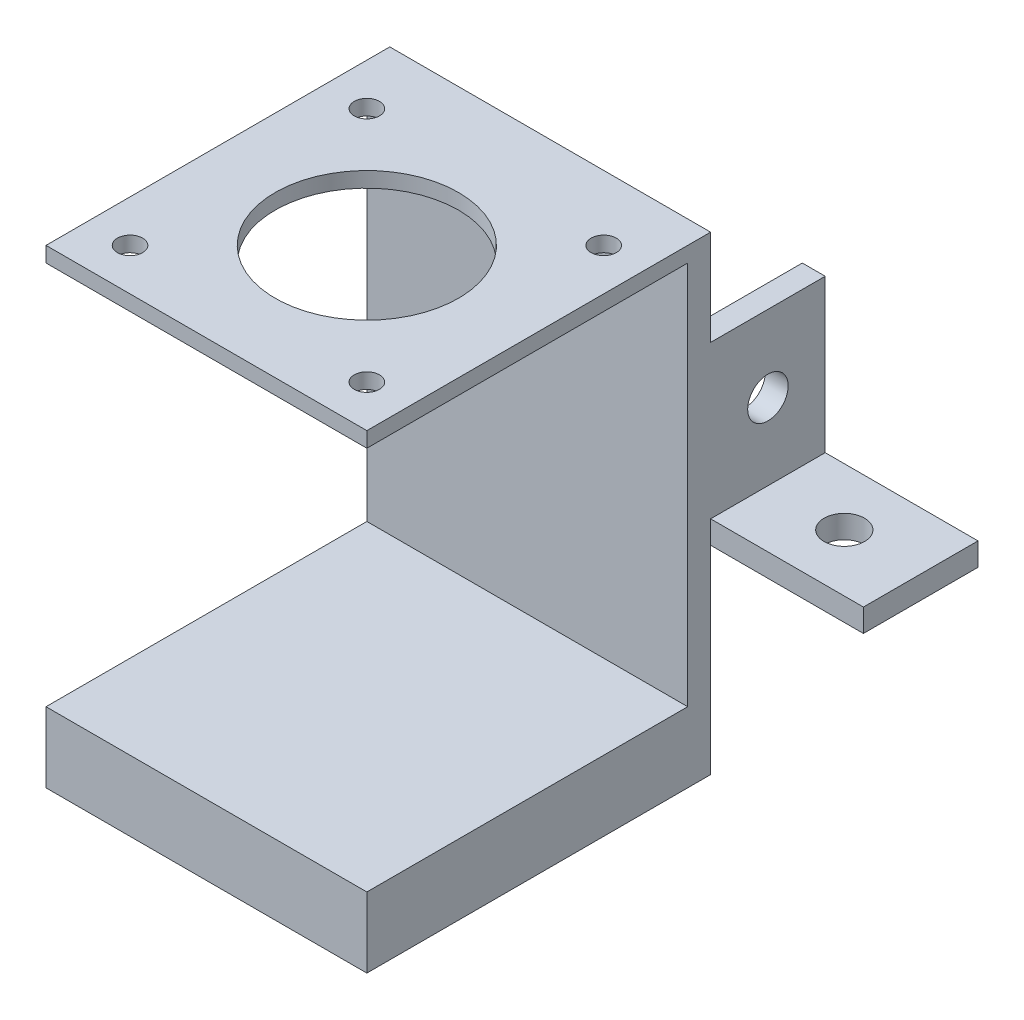
ISO-10303-21;
HEADER;
FILE_DESCRIPTION(('STEP AP214'),'2;1');
FILE_NAME('part.step','',(''),(''),'','','');
FILE_SCHEMA(('AUTOMOTIVE_DESIGN { 1 0 10303 214 1 1 1 1 }'));
ENDSEC;
DATA;
#1=APPLICATION_CONTEXT('core data for automotive mechanical design processes');
#2=APPLICATION_PROTOCOL_DEFINITION('international standard','automotive_design',2000,#1);
#3=PRODUCT_CONTEXT('',#1,'mechanical');
#4=PRODUCT('Part','Part','',(#3));
#5=PRODUCT_RELATED_PRODUCT_CATEGORY('part','',(#4));
#6=PRODUCT_DEFINITION_FORMATION('','',#4);
#7=PRODUCT_DEFINITION_CONTEXT('part definition',#1,'design');
#8=PRODUCT_DEFINITION('design','',#6,#7);
#9=PRODUCT_DEFINITION_SHAPE('','',#8);
#10=(LENGTH_UNIT() NAMED_UNIT(*) SI_UNIT(.MILLI.,.METRE.));
#11=(NAMED_UNIT(*) PLANE_ANGLE_UNIT() SI_UNIT($,.RADIAN.));
#12=(NAMED_UNIT(*) SI_UNIT($,.STERADIAN.) SOLID_ANGLE_UNIT());
#13=UNCERTAINTY_MEASURE_WITH_UNIT(LENGTH_MEASURE(1.E-05),#10,'distance_accuracy_value','');
#14=(GEOMETRIC_REPRESENTATION_CONTEXT(3) GLOBAL_UNCERTAINTY_ASSIGNED_CONTEXT((#13)) GLOBAL_UNIT_ASSIGNED_CONTEXT((#10,
#11,#12)) REPRESENTATION_CONTEXT('',''));
#15=CARTESIAN_POINT('',(0.,0.,0.));
#16=DIRECTION('',(0.,0.,1.));
#17=DIRECTION('',(1.,0.,0.));
#18=AXIS2_PLACEMENT_3D('',#15,#16,#17);
#19=CARTESIAN_POINT('',(23.8060344827586,11.3599137931034,3.));
#20=DIRECTION('',(-1.,0.,0.));
#21=DIRECTION('',(0.,-1.,0.));
#22=AXIS2_PLACEMENT_3D('',#19,#20,#21);
#23=PLANE('',#22);
#24=CARTESIAN_POINT('',(23.8060344827586,-11.1400862068966,-7.5));
#25=DIRECTION('',(-1.,0.,0.));
#26=DIRECTION('',(0.,-1.,0.));
#27=AXIS2_PLACEMENT_3D('',#24,#25,#26);
#28=CIRCLE('',#27,2.65);
#29=CARTESIAN_POINT('',(23.8060344827586,-13.7900862068966,-7.5));
#30=VERTEX_POINT('',#29);
#31=EDGE_CURVE('E169',#30,#30,#28,.T.);
#32=ORIENTED_EDGE('',*,*,#31,.T.);
#33=EDGE_LOOP('',(#32));
#34=FACE_BOUND('',#33,.T.);
#35=DIRECTION('',(0.,-1.,0.));
#36=VECTOR('',#35,1.);
#37=CARTESIAN_POINT('',(23.8060344827586,-24.1400862068966,0.));
#38=LINE('',#37,#36);
#39=CARTESIAN_POINT('',(23.8060344827586,-21.1400862068966,0.));
#40=VERTEX_POINT('',#39);
#41=CARTESIAN_POINT('',(23.8060344827586,-24.1400862068966,0.));
#42=VERTEX_POINT('',#41);
#43=EDGE_CURVE('E161',#40,#42,#38,.T.);
#44=ORIENTED_EDGE('',*,*,#43,.F.);
#45=DIRECTION('',(0.,0.,1.));
#46=VECTOR('',#45,1.);
#47=CARTESIAN_POINT('',(23.8060344827586,-21.1400862068966,-15.));
#48=LINE('',#47,#46);
#49=CARTESIAN_POINT('',(23.8060344827586,-21.1400862068966,-15.));
#50=VERTEX_POINT('',#49);
#51=EDGE_CURVE('E54',#50,#40,#48,.T.);
#52=ORIENTED_EDGE('',*,*,#51,.F.);
#53=DIRECTION('',(0.,-1.,0.));
#54=VECTOR('',#53,1.);
#55=CARTESIAN_POINT('',(23.8060344827586,-21.1400862068966,-15.));
#56=LINE('',#55,#54);
#57=CARTESIAN_POINT('',(23.8060344827586,-1.14008620689655,-15.));
#58=VERTEX_POINT('',#57);
#59=EDGE_CURVE('E165',#58,#50,#56,.T.);
#60=ORIENTED_EDGE('',*,*,#59,.F.);
#61=DIRECTION('',(0.,0.,1.));
#62=VECTOR('',#61,1.);
#63=CARTESIAN_POINT('',(23.8060344827586,-1.14008620689655,-15.));
#64=LINE('',#63,#62);
#65=CARTESIAN_POINT('',(23.8060344827586,-1.14008620689655,0.));
#66=VERTEX_POINT('',#65);
#67=EDGE_CURVE('E186',#58,#66,#64,.T.);
#68=ORIENTED_EDGE('',*,*,#67,.T.);
#69=DIRECTION('',(0.,1.,0.));
#70=VECTOR('',#69,1.);
#71=CARTESIAN_POINT('',(23.8060344827586,11.3599137931034,0.));
#72=LINE('',#71,#70);
#73=CARTESIAN_POINT('',(23.8060344827586,11.3599137931034,0.));
#74=VERTEX_POINT('',#73);
#75=EDGE_CURVE('E278',#66,#74,#72,.T.);
#76=ORIENTED_EDGE('',*,*,#75,.T.);
#77=DIRECTION('',(0.,0.,-1.));
#78=VECTOR('',#77,1.);
#79=CARTESIAN_POINT('',(23.8060344827586,11.3599137931034,3.));
#80=LINE('',#79,#78);
#81=CARTESIAN_POINT('',(23.8060344827586,11.3599137931034,45.));
#82=VERTEX_POINT('',#81);
#83=EDGE_CURVE('E285',#82,#74,#80,.T.);
#84=ORIENTED_EDGE('',*,*,#83,.F.);
#85=DIRECTION('',(0.,1.,0.));
#86=VECTOR('',#85,1.);
#87=CARTESIAN_POINT('',(23.8060344827586,11.3599137931034,45.));
#88=LINE('',#87,#86);
#89=CARTESIAN_POINT('',(23.8060344827586,9.35991379310345,45.));
#90=VERTEX_POINT('',#89);
#91=EDGE_CURVE('E252',#90,#82,#88,.T.);
#92=ORIENTED_EDGE('',*,*,#91,.F.);
#93=DIRECTION('',(0.,0.,-1.));
#94=VECTOR('',#93,1.);
#95=CARTESIAN_POINT('',(23.8060344827586,9.35991379310345,45.));
#96=LINE('',#95,#94);
#97=CARTESIAN_POINT('',(23.8060344827586,9.35991379310345,3.));
#98=VERTEX_POINT('',#97);
#99=EDGE_CURVE('E258',#90,#98,#96,.T.);
#100=ORIENTED_EDGE('',*,*,#99,.T.);
#101=DIRECTION('',(0.,1.,0.));
#102=VECTOR('',#101,1.);
#103=CARTESIAN_POINT('',(23.8060344827586,11.3599137931034,3.));
#104=LINE('',#103,#102);
#105=CARTESIAN_POINT('',(23.8060344827586,-40.9400862068966,3.));
#106=VERTEX_POINT('',#105);
#107=EDGE_CURVE('E270',#106,#98,#104,.T.);
#108=ORIENTED_EDGE('',*,*,#107,.F.);
#109=DIRECTION('',(0.,0.,-1.));
#110=VECTOR('',#109,1.);
#111=CARTESIAN_POINT('',(23.8060344827586,-40.9400862068966,45.));
#112=LINE('',#111,#110);
#113=CARTESIAN_POINT('',(23.8060344827586,-40.9400862068966,45.));
#114=VERTEX_POINT('',#113);
#115=EDGE_CURVE('E244',#114,#106,#112,.T.);
#116=ORIENTED_EDGE('',*,*,#115,.F.);
#117=DIRECTION('',(0.,1.,0.));
#118=VECTOR('',#117,1.);
#119=CARTESIAN_POINT('',(23.8060344827586,-50.1400862068966,45.));
#120=LINE('',#119,#118);
#121=CARTESIAN_POINT('',(23.8060344827586,-50.1400862068966,45.));
#122=VERTEX_POINT('',#121);
#123=EDGE_CURVE('E236',#122,#114,#120,.T.);
#124=ORIENTED_EDGE('',*,*,#123,.F.);
#125=DIRECTION('',(0.,0.,-1.));
#126=VECTOR('',#125,1.);
#127=CARTESIAN_POINT('',(23.8060344827586,-50.1400862068966,3.));
#128=LINE('',#127,#126);
#129=CARTESIAN_POINT('',(23.8060344827586,-50.1400862068966,0.));
#130=VERTEX_POINT('',#129);
#131=EDGE_CURVE('E47',#122,#130,#128,.T.);
#132=ORIENTED_EDGE('',*,*,#131,.T.);
#133=EDGE_CURVE('E279',#130,#42,#72,.T.);
#134=ORIENTED_EDGE('',*,*,#133,.T.);
#135=EDGE_LOOP('',(#44,#52,#60,#68,#76,#84,#92,#100,#108,#116,#124,#132,#134));
#136=FACE_BOUND('',#135,.T.);
#137=ADVANCED_FACE('F39',(#34,#136),#23,.F.);
#138=CARTESIAN_POINT('',(0.,0.,0.));
#139=DIRECTION('',(0.,0.,1.));
#140=DIRECTION('',(1.,0.,0.));
#141=AXIS2_PLACEMENT_3D('',#138,#139,#140);
#142=PLANE('',#141);
#143=DIRECTION('',(-1.,0.,0.));
#144=VECTOR('',#143,1.);
#145=CARTESIAN_POINT('',(23.8060344827586,-24.1400862068966,0.));
#146=LINE('',#145,#144);
#147=CARTESIAN_POINT('',(20.8060344827586,-24.1400862068966,0.));
#148=VERTEX_POINT('',#147);
#149=EDGE_CURVE('E177',#42,#148,#146,.T.);
#150=ORIENTED_EDGE('',*,*,#149,.F.);
#151=ORIENTED_EDGE('',*,*,#133,.F.);
#152=DIRECTION('',(1.,0.,0.));
#153=VECTOR('',#152,1.);
#154=CARTESIAN_POINT('',(-18.1939655172414,-50.1400862068966,0.));
#155=LINE('',#154,#153);
#156=CARTESIAN_POINT('',(-18.1939655172414,-50.1400862068966,0.));
#157=VERTEX_POINT('',#156);
#158=EDGE_CURVE('E276',#157,#130,#155,.T.);
#159=ORIENTED_EDGE('',*,*,#158,.F.);
#160=DIRECTION('',(0.,-1.,0.));
#161=VECTOR('',#160,1.);
#162=CARTESIAN_POINT('',(-18.1939655172414,11.3599137931034,0.));
#163=LINE('',#162,#161);
#164=CARTESIAN_POINT('',(-18.1939655172414,11.3599137931034,0.));
#165=VERTEX_POINT('',#164);
#166=EDGE_CURVE('E266',#165,#157,#163,.T.);
#167=ORIENTED_EDGE('',*,*,#166,.F.);
#168=DIRECTION('',(-1.,0.,0.));
#169=VECTOR('',#168,1.);
#170=CARTESIAN_POINT('',(-18.1939655172414,11.3599137931034,0.));
#171=LINE('',#170,#169);
#172=EDGE_CURVE('E271',#74,#165,#171,.T.);
#173=ORIENTED_EDGE('',*,*,#172,.F.);
#174=ORIENTED_EDGE('',*,*,#75,.F.);
#175=DIRECTION('',(1.,0.,0.));
#176=VECTOR('',#175,1.);
#177=CARTESIAN_POINT('',(23.8060344827586,-1.14008620689655,0.));
#178=LINE('',#177,#176);
#179=CARTESIAN_POINT('',(20.8060344827586,-1.14008620689655,0.));
#180=VERTEX_POINT('',#179);
#181=EDGE_CURVE('E180',#180,#66,#178,.T.);
#182=ORIENTED_EDGE('',*,*,#181,.F.);
#183=DIRECTION('',(0.,1.,0.));
#184=VECTOR('',#183,1.);
#185=CARTESIAN_POINT('',(20.8060344827586,-21.1400862068966,0.));
#186=LINE('',#185,#184);
#187=EDGE_CURVE('E62',#148,#180,#186,.T.);
#188=ORIENTED_EDGE('',*,*,#187,.F.);
#189=EDGE_LOOP('',(#150,#151,#159,#167,#173,#174,#182,#188));
#190=FACE_BOUND('',#189,.T.);
#191=ADVANCED_FACE('F294',(#190),#142,.F.);
#192=CARTESIAN_POINT('',(0.,0.,3.));
#193=DIRECTION('',(0.,0.,1.));
#194=DIRECTION('',(1.,0.,0.));
#195=AXIS2_PLACEMENT_3D('',#192,#193,#194);
#196=PLANE('',#195);
#197=DIRECTION('',(0.,-1.,0.));
#198=VECTOR('',#197,1.);
#199=CARTESIAN_POINT('',(-18.1939655172414,11.3599137931034,3.));
#200=LINE('',#199,#198);
#201=CARTESIAN_POINT('',(-18.1939655172414,9.35991379310345,3.));
#202=VERTEX_POINT('',#201);
#203=CARTESIAN_POINT('',(-18.1939655172414,-40.9400862068966,3.));
#204=VERTEX_POINT('',#203);
#205=EDGE_CURVE('E267',#202,#204,#200,.T.);
#206=ORIENTED_EDGE('',*,*,#205,.T.);
#207=DIRECTION('',(-1.,0.,0.));
#208=VECTOR('',#207,1.);
#209=CARTESIAN_POINT('',(-18.1939655172414,-40.9400862068966,3.));
#210=LINE('',#209,#208);
#211=EDGE_CURVE('E227',#106,#204,#210,.T.);
#212=ORIENTED_EDGE('',*,*,#211,.F.);
#213=ORIENTED_EDGE('',*,*,#107,.T.);
#214=DIRECTION('',(1.,0.,0.));
#215=VECTOR('',#214,1.);
#216=CARTESIAN_POINT('',(-18.1939655172414,9.35991379310345,3.));
#217=LINE('',#216,#215);
#218=EDGE_CURVE('E246',#202,#98,#217,.T.);
#219=ORIENTED_EDGE('',*,*,#218,.F.);
#220=EDGE_LOOP('',(#206,#212,#213,#219));
#221=FACE_BOUND('',#220,.T.);
#222=ADVANCED_FACE('F333',(#221),#196,.T.);
#223=CARTESIAN_POINT('',(-18.1939655172414,11.3599137931034,3.));
#224=DIRECTION('',(1.,0.,0.));
#225=DIRECTION('',(0.,1.,0.));
#226=AXIS2_PLACEMENT_3D('',#223,#224,#225);
#227=PLANE('',#226);
#228=ORIENTED_EDGE('',*,*,#166,.T.);
#229=DIRECTION('',(0.,0.,-1.));
#230=VECTOR('',#229,1.);
#231=CARTESIAN_POINT('',(-18.1939655172414,-50.1400862068966,3.));
#232=LINE('',#231,#230);
#233=CARTESIAN_POINT('',(-18.1939655172414,-50.1400862068966,45.));
#234=VERTEX_POINT('',#233);
#235=EDGE_CURVE('E11',#234,#157,#232,.T.);
#236=ORIENTED_EDGE('',*,*,#235,.F.);
#237=DIRECTION('',(0.,-1.,0.));
#238=VECTOR('',#237,1.);
#239=CARTESIAN_POINT('',(-18.1939655172414,-50.1400862068966,45.));
#240=LINE('',#239,#238);
#241=CARTESIAN_POINT('',(-18.1939655172414,-40.9400862068966,45.));
#242=VERTEX_POINT('',#241);
#243=EDGE_CURVE('E230',#242,#234,#240,.T.);
#244=ORIENTED_EDGE('',*,*,#243,.F.);
#245=DIRECTION('',(0.,0.,-1.));
#246=VECTOR('',#245,1.);
#247=CARTESIAN_POINT('',(-18.1939655172414,-40.9400862068966,45.));
#248=LINE('',#247,#246);
#249=EDGE_CURVE('E240',#242,#204,#248,.T.);
#250=ORIENTED_EDGE('',*,*,#249,.T.);
#251=ORIENTED_EDGE('',*,*,#205,.F.);
#252=DIRECTION('',(0.,0.,-1.));
#253=VECTOR('',#252,1.);
#254=CARTESIAN_POINT('',(-18.1939655172414,9.35991379310345,45.));
#255=LINE('',#254,#253);
#256=CARTESIAN_POINT('',(-18.1939655172414,9.35991379310345,45.));
#257=VERTEX_POINT('',#256);
#258=EDGE_CURVE('E263',#257,#202,#255,.T.);
#259=ORIENTED_EDGE('',*,*,#258,.F.);
#260=DIRECTION('',(0.,-1.,0.));
#261=VECTOR('',#260,1.);
#262=CARTESIAN_POINT('',(-18.1939655172414,11.3599137931034,45.));
#263=LINE('',#262,#261);
#264=CARTESIAN_POINT('',(-18.1939655172414,11.3599137931034,45.));
#265=VERTEX_POINT('',#264);
#266=EDGE_CURVE('E247',#265,#257,#263,.T.);
#267=ORIENTED_EDGE('',*,*,#266,.F.);
#268=DIRECTION('',(0.,0.,-1.));
#269=VECTOR('',#268,1.);
#270=CARTESIAN_POINT('',(-18.1939655172414,11.3599137931034,3.));
#271=LINE('',#270,#269);
#272=EDGE_CURVE('E273',#265,#165,#271,.T.);
#273=ORIENTED_EDGE('',*,*,#272,.T.);
#274=EDGE_LOOP('',(#228,#236,#244,#250,#251,#259,#267,#273));
#275=FACE_BOUND('',#274,.T.);
#276=ADVANCED_FACE('F41',(#275),#227,.F.);
#277=CARTESIAN_POINT('',(-18.1939655172414,-50.1400862068966,3.));
#278=DIRECTION('',(0.,1.,0.));
#279=DIRECTION('',(0.,0.,1.));
#280=AXIS2_PLACEMENT_3D('',#277,#278,#279);
#281=PLANE('',#280);
#282=ORIENTED_EDGE('',*,*,#158,.T.);
#283=ORIENTED_EDGE('',*,*,#131,.F.);
#284=DIRECTION('',(1.,0.,0.));
#285=VECTOR('',#284,1.);
#286=CARTESIAN_POINT('',(-18.1939655172414,-50.1400862068966,45.));
#287=LINE('',#286,#285);
#288=EDGE_CURVE('E233',#234,#122,#287,.T.);
#289=ORIENTED_EDGE('',*,*,#288,.F.);
#290=ORIENTED_EDGE('',*,*,#235,.T.);
#291=EDGE_LOOP('',(#282,#283,#289,#290));
#292=FACE_BOUND('',#291,.T.);
#293=ADVANCED_FACE('F337',(#292),#281,.F.);
#294=CARTESIAN_POINT('',(-18.1939655172414,11.3599137931034,3.));
#295=DIRECTION('',(0.,-1.,0.));
#296=DIRECTION('',(0.,0.,-1.));
#297=AXIS2_PLACEMENT_3D('',#294,#295,#296);
#298=PLANE('',#297);
#299=CARTESIAN_POINT('',(-12.6939655172412,11.3599137931034,39.4999999999997));
#300=DIRECTION('',(0.,-1.,0.));
#301=DIRECTION('',(0.,0.,-1.));
#302=AXIS2_PLACEMENT_3D('',#299,#300,#301);
#303=CIRCLE('',#302,1.65);
#304=CARTESIAN_POINT('',(-12.6939655172412,11.3599137931034,37.8499999999997));
#305=VERTEX_POINT('',#304);
#306=EDGE_CURVE('E219',#305,#305,#303,.T.);
#307=ORIENTED_EDGE('',*,*,#306,.T.);
#308=EDGE_LOOP('',(#307));
#309=FACE_BOUND('',#308,.T.);
#310=CARTESIAN_POINT('',(-12.6939655172411,11.3599137931034,8.49999999999968));
#311=DIRECTION('',(0.,-1.,0.));
#312=DIRECTION('',(0.,0.,-1.));
#313=AXIS2_PLACEMENT_3D('',#310,#311,#312);
#314=CIRCLE('',#313,1.64999999999999);
#315=CARTESIAN_POINT('',(-12.6939655172411,11.3599137931034,6.84999999999969));
#316=VERTEX_POINT('',#315);
#317=EDGE_CURVE('E213',#316,#316,#314,.T.);
#318=ORIENTED_EDGE('',*,*,#317,.T.);
#319=EDGE_LOOP('',(#318));
#320=FACE_BOUND('',#319,.T.);
#321=CARTESIAN_POINT('',(18.306034482759,11.3599137931034,8.49999999999994));
#322=DIRECTION('',(0.,-1.,0.));
#323=DIRECTION('',(0.,0.,-1.));
#324=AXIS2_PLACEMENT_3D('',#321,#322,#323);
#325=CIRCLE('',#324,1.65);
#326=CARTESIAN_POINT('',(18.306034482759,11.3599137931034,6.84999999999995));
#327=VERTEX_POINT('',#326);
#328=EDGE_CURVE('E207',#327,#327,#325,.T.);
#329=ORIENTED_EDGE('',*,*,#328,.T.);
#330=EDGE_LOOP('',(#329));
#331=FACE_BOUND('',#330,.T.);
#332=CARTESIAN_POINT('',(18.3060344827586,11.3599137931034,39.5));
#333=DIRECTION('',(0.,-1.,0.));
#334=DIRECTION('',(0.,0.,-1.));
#335=AXIS2_PLACEMENT_3D('',#332,#333,#334);
#336=CIRCLE('',#335,1.65);
#337=CARTESIAN_POINT('',(18.3060344827586,11.3599137931034,37.85));
#338=VERTEX_POINT('',#337);
#339=EDGE_CURVE('E200',#338,#338,#336,.T.);
#340=ORIENTED_EDGE('',*,*,#339,.T.);
#341=EDGE_LOOP('',(#340));
#342=FACE_BOUND('',#341,.T.);
#343=CARTESIAN_POINT('',(2.80603448275863,11.3599137931034,24.));
#344=DIRECTION('',(0.,-1.,0.));
#345=DIRECTION('',(0.,0.,-1.));
#346=AXIS2_PLACEMENT_3D('',#343,#344,#345);
#347=CIRCLE('',#346,12.);
#348=CARTESIAN_POINT('',(2.80603448275863,11.3599137931034,12.));
#349=VERTEX_POINT('',#348);
#350=EDGE_CURVE('E224',#349,#349,#347,.T.);
#351=ORIENTED_EDGE('',*,*,#350,.T.);
#352=EDGE_LOOP('',(#351));
#353=FACE_BOUND('',#352,.T.);
#354=ORIENTED_EDGE('',*,*,#172,.T.);
#355=ORIENTED_EDGE('',*,*,#272,.F.);
#356=DIRECTION('',(-1.,0.,0.));
#357=VECTOR('',#356,1.);
#358=CARTESIAN_POINT('',(-18.1939655172414,11.3599137931034,45.));
#359=LINE('',#358,#357);
#360=EDGE_CURVE('E255',#82,#265,#359,.T.);
#361=ORIENTED_EDGE('',*,*,#360,.F.);
#362=ORIENTED_EDGE('',*,*,#83,.T.);
#363=EDGE_LOOP('',(#354,#355,#361,#362));
#364=FACE_BOUND('',#363,.T.);
#365=ADVANCED_FACE('F336',(#309,#320,#331,#342,#353,#364),#298,.F.);
#366=CARTESIAN_POINT('',(-18.1939655172414,9.35991379310345,45.));
#367=DIRECTION('',(0.,1.,0.));
#368=DIRECTION('',(-1.,0.,0.));
#369=AXIS2_PLACEMENT_3D('',#366,#367,#368);
#370=PLANE('',#369);
#371=CARTESIAN_POINT('',(-12.6939655172412,9.35991379310345,39.4999999999997));
#372=DIRECTION('',(0.,-1.,0.));
#373=DIRECTION('',(0.,0.,-1.));
#374=AXIS2_PLACEMENT_3D('',#371,#372,#373);
#375=CIRCLE('',#374,1.65);
#376=CARTESIAN_POINT('',(-12.6939655172412,9.35991379310345,37.8499999999997));
#377=VERTEX_POINT('',#376);
#378=EDGE_CURVE('E199',#377,#377,#375,.T.);
#379=ORIENTED_EDGE('',*,*,#378,.F.);
#380=EDGE_LOOP('',(#379));
#381=FACE_BOUND('',#380,.T.);
#382=CARTESIAN_POINT('',(-12.6939655172411,9.35991379310345,8.49999999999968));
#383=DIRECTION('',(0.,-1.,0.));
#384=DIRECTION('',(0.,0.,-1.));
#385=AXIS2_PLACEMENT_3D('',#382,#383,#384);
#386=CIRCLE('',#385,1.64999999999999);
#387=CARTESIAN_POINT('',(-12.6939655172411,9.35991379310345,6.84999999999969));
#388=VERTEX_POINT('',#387);
#389=EDGE_CURVE('E216',#388,#388,#386,.T.);
#390=ORIENTED_EDGE('',*,*,#389,.F.);
#391=EDGE_LOOP('',(#390));
#392=FACE_BOUND('',#391,.T.);
#393=CARTESIAN_POINT('',(18.306034482759,9.35991379310345,8.49999999999994));
#394=DIRECTION('',(0.,-1.,0.));
#395=DIRECTION('',(0.,0.,-1.));
#396=AXIS2_PLACEMENT_3D('',#393,#394,#395);
#397=CIRCLE('',#396,1.65);
#398=CARTESIAN_POINT('',(18.306034482759,9.35991379310345,6.84999999999995));
#399=VERTEX_POINT('',#398);
#400=EDGE_CURVE('E210',#399,#399,#397,.T.);
#401=ORIENTED_EDGE('',*,*,#400,.F.);
#402=EDGE_LOOP('',(#401));
#403=FACE_BOUND('',#402,.T.);
#404=CARTESIAN_POINT('',(18.3060344827586,9.35991379310345,39.5));
#405=DIRECTION('',(0.,-1.,0.));
#406=DIRECTION('',(0.,0.,-1.));
#407=AXIS2_PLACEMENT_3D('',#404,#405,#406);
#408=CIRCLE('',#407,1.65);
#409=CARTESIAN_POINT('',(18.3060344827586,9.35991379310345,37.85));
#410=VERTEX_POINT('',#409);
#411=EDGE_CURVE('E204',#410,#410,#408,.T.);
#412=ORIENTED_EDGE('',*,*,#411,.F.);
#413=EDGE_LOOP('',(#412));
#414=FACE_BOUND('',#413,.T.);
#415=CARTESIAN_POINT('',(2.80603448275863,9.35991379310345,24.));
#416=DIRECTION('',(0.,-1.,0.));
#417=DIRECTION('',(0.,0.,-1.));
#418=AXIS2_PLACEMENT_3D('',#415,#416,#417);
#419=CIRCLE('',#418,12.);
#420=CARTESIAN_POINT('',(2.80603448275863,9.35991379310345,12.));
#421=VERTEX_POINT('',#420);
#422=EDGE_CURVE('E203',#421,#421,#419,.T.);
#423=ORIENTED_EDGE('',*,*,#422,.F.);
#424=EDGE_LOOP('',(#423));
#425=FACE_BOUND('',#424,.T.);
#426=ORIENTED_EDGE('',*,*,#218,.T.);
#427=ORIENTED_EDGE('',*,*,#99,.F.);
#428=DIRECTION('',(1.,0.,0.));
#429=VECTOR('',#428,1.);
#430=CARTESIAN_POINT('',(-18.1939655172414,9.35991379310345,45.));
#431=LINE('',#430,#429);
#432=EDGE_CURVE('E250',#257,#90,#431,.T.);
#433=ORIENTED_EDGE('',*,*,#432,.F.);
#434=ORIENTED_EDGE('',*,*,#258,.T.);
#435=EDGE_LOOP('',(#426,#427,#433,#434));
#436=FACE_BOUND('',#435,.T.);
#437=ADVANCED_FACE('F344',(#381,#392,#403,#414,#425,#436),#370,.F.);
#438=CARTESIAN_POINT('',(0.,0.,45.));
#439=DIRECTION('',(0.,0.,1.));
#440=DIRECTION('',(1.,0.,0.));
#441=AXIS2_PLACEMENT_3D('',#438,#439,#440);
#442=PLANE('',#441);
#443=ORIENTED_EDGE('',*,*,#266,.T.);
#444=ORIENTED_EDGE('',*,*,#432,.T.);
#445=ORIENTED_EDGE('',*,*,#91,.T.);
#446=ORIENTED_EDGE('',*,*,#360,.T.);
#447=EDGE_LOOP('',(#443,#444,#445,#446));
#448=FACE_BOUND('',#447,.T.);
#449=ADVANCED_FACE('F354',(#448),#442,.T.);
#450=CARTESIAN_POINT('',(-18.1939655172414,-40.9400862068966,45.));
#451=DIRECTION('',(0.,-1.,0.));
#452=DIRECTION('',(0.,0.,-1.));
#453=AXIS2_PLACEMENT_3D('',#450,#451,#452);
#454=PLANE('',#453);
#455=ORIENTED_EDGE('',*,*,#211,.T.);
#456=ORIENTED_EDGE('',*,*,#249,.F.);
#457=DIRECTION('',(-1.,0.,0.));
#458=VECTOR('',#457,1.);
#459=CARTESIAN_POINT('',(-18.1939655172414,-40.9400862068966,45.));
#460=LINE('',#459,#458);
#461=EDGE_CURVE('E238',#114,#242,#460,.T.);
#462=ORIENTED_EDGE('',*,*,#461,.F.);
#463=ORIENTED_EDGE('',*,*,#115,.T.);
#464=EDGE_LOOP('',(#455,#456,#462,#463));
#465=FACE_BOUND('',#464,.T.);
#466=ADVANCED_FACE('F365',(#465),#454,.F.);
#467=CARTESIAN_POINT('',(0.,0.,45.));
#468=DIRECTION('',(0.,0.,-1.));
#469=DIRECTION('',(-1.,0.,0.));
#470=AXIS2_PLACEMENT_3D('',#467,#468,#469);
#471=PLANE('',#470);
#472=ORIENTED_EDGE('',*,*,#243,.T.);
#473=ORIENTED_EDGE('',*,*,#288,.T.);
#474=ORIENTED_EDGE('',*,*,#123,.T.);
#475=ORIENTED_EDGE('',*,*,#461,.T.);
#476=EDGE_LOOP('',(#472,#473,#474,#475));
#477=FACE_BOUND('',#476,.T.);
#478=ADVANCED_FACE('F367',(#477),#471,.F.);
#479=CARTESIAN_POINT('',(2.80603448275863,11.3599137931034,24.));
#480=DIRECTION('',(0.,-1.,0.));
#481=DIRECTION('',(0.,0.,-1.));
#482=AXIS2_PLACEMENT_3D('',#479,#480,#481);
#483=CYLINDRICAL_SURFACE('',#482,12.);
#484=ORIENTED_EDGE('',*,*,#350,.F.);
#485=EDGE_LOOP('',(#484));
#486=FACE_BOUND('',#485,.T.);
#487=ORIENTED_EDGE('',*,*,#422,.T.);
#488=EDGE_LOOP('',(#487));
#489=FACE_BOUND('',#488,.T.);
#490=ADVANCED_FACE('F369',(#486,#489),#483,.F.);
#491=CARTESIAN_POINT('',(18.3060344827586,11.3599137931034,39.5));
#492=DIRECTION('',(0.,-1.,0.));
#493=DIRECTION('',(0.,0.,-1.));
#494=AXIS2_PLACEMENT_3D('',#491,#492,#493);
#495=CYLINDRICAL_SURFACE('',#494,1.65);
#496=ORIENTED_EDGE('',*,*,#339,.F.);
#497=EDGE_LOOP('',(#496));
#498=FACE_BOUND('',#497,.T.);
#499=ORIENTED_EDGE('',*,*,#411,.T.);
#500=EDGE_LOOP('',(#499));
#501=FACE_BOUND('',#500,.T.);
#502=ADVANCED_FACE('F375',(#498,#501),#495,.F.);
#503=CARTESIAN_POINT('',(18.306034482759,11.3599137931034,8.49999999999994));
#504=DIRECTION('',(0.,-1.,0.));
#505=DIRECTION('',(0.,0.,-1.));
#506=AXIS2_PLACEMENT_3D('',#503,#504,#505);
#507=CYLINDRICAL_SURFACE('',#506,1.65);
#508=ORIENTED_EDGE('',*,*,#328,.F.);
#509=EDGE_LOOP('',(#508));
#510=FACE_BOUND('',#509,.T.);
#511=ORIENTED_EDGE('',*,*,#400,.T.);
#512=EDGE_LOOP('',(#511));
#513=FACE_BOUND('',#512,.T.);
#514=ADVANCED_FACE('F433',(#510,#513),#507,.F.);
#515=CARTESIAN_POINT('',(-12.6939655172411,11.3599137931034,8.49999999999968));
#516=DIRECTION('',(0.,-1.,0.));
#517=DIRECTION('',(0.,0.,-1.));
#518=AXIS2_PLACEMENT_3D('',#515,#516,#517);
#519=CYLINDRICAL_SURFACE('',#518,1.64999999999999);
#520=ORIENTED_EDGE('',*,*,#317,.F.);
#521=EDGE_LOOP('',(#520));
#522=FACE_BOUND('',#521,.T.);
#523=ORIENTED_EDGE('',*,*,#389,.T.);
#524=EDGE_LOOP('',(#523));
#525=FACE_BOUND('',#524,.T.);
#526=ADVANCED_FACE('F441',(#522,#525),#519,.F.);
#527=CARTESIAN_POINT('',(-12.6939655172412,11.3599137931034,39.4999999999997));
#528=DIRECTION('',(0.,-1.,0.));
#529=DIRECTION('',(0.,0.,-1.));
#530=AXIS2_PLACEMENT_3D('',#527,#528,#529);
#531=CYLINDRICAL_SURFACE('',#530,1.65);
#532=ORIENTED_EDGE('',*,*,#306,.F.);
#533=EDGE_LOOP('',(#532));
#534=FACE_BOUND('',#533,.T.);
#535=ORIENTED_EDGE('',*,*,#378,.T.);
#536=EDGE_LOOP('',(#535));
#537=FACE_BOUND('',#536,.T.);
#538=ADVANCED_FACE('F449',(#534,#537),#531,.F.);
#539=CARTESIAN_POINT('',(23.8060344827586,-24.1400862068966,-15.));
#540=DIRECTION('',(0.,1.,0.));
#541=DIRECTION('',(0.,0.,1.));
#542=AXIS2_PLACEMENT_3D('',#539,#540,#541);
#543=PLANE('',#542);
#544=CARTESIAN_POINT('',(33.8060344827586,-24.1400862068966,-7.5));
#545=DIRECTION('',(0.,1.,0.));
#546=DIRECTION('',(0.,0.,1.));
#547=AXIS2_PLACEMENT_3D('',#544,#545,#546);
#548=CIRCLE('',#547,2.65);
#549=CARTESIAN_POINT('',(33.8060344827586,-24.1400862068966,-4.85));
#550=VERTEX_POINT('',#549);
#551=EDGE_CURVE('E311',#550,#550,#548,.T.);
#552=ORIENTED_EDGE('',*,*,#551,.T.);
#553=EDGE_LOOP('',(#552));
#554=FACE_BOUND('',#553,.T.);
#555=ORIENTED_EDGE('',*,*,#149,.T.);
#556=DIRECTION('',(0.,0.,1.));
#557=VECTOR('',#556,1.);
#558=CARTESIAN_POINT('',(20.8060344827586,-24.1400862068966,-15.));
#559=LINE('',#558,#557);
#560=CARTESIAN_POINT('',(20.8060344827586,-24.1400862068966,-15.));
#561=VERTEX_POINT('',#560);
#562=EDGE_CURVE('E196',#561,#148,#559,.T.);
#563=ORIENTED_EDGE('',*,*,#562,.F.);
#564=DIRECTION('',(-1.,0.,0.));
#565=VECTOR('',#564,1.);
#566=CARTESIAN_POINT('',(23.8060344827586,-24.1400862068966,-15.));
#567=LINE('',#566,#565);
#568=CARTESIAN_POINT('',(43.8060344827586,-24.1400862068966,-15.));
#569=VERTEX_POINT('',#568);
#570=EDGE_CURVE('E179',#569,#561,#567,.T.);
#571=ORIENTED_EDGE('',*,*,#570,.F.);
#572=DIRECTION('',(0.,0.,-1.));
#573=VECTOR('',#572,1.);
#574=CARTESIAN_POINT('',(43.8060344827586,-24.1400862068966,-15.));
#575=LINE('',#574,#573);
#576=CARTESIAN_POINT('',(43.8060344827586,-24.1400862068966,0.));
#577=VERTEX_POINT('',#576);
#578=EDGE_CURVE('E159',#577,#569,#575,.T.);
#579=ORIENTED_EDGE('',*,*,#578,.F.);
#580=DIRECTION('',(-1.,0.,0.));
#581=VECTOR('',#580,1.);
#582=CARTESIAN_POINT('',(43.8060344827586,-24.1400862068966,0.));
#583=LINE('',#582,#581);
#584=EDGE_CURVE('E171',#577,#42,#583,.T.);
#585=ORIENTED_EDGE('',*,*,#584,.T.);
#586=EDGE_LOOP('',(#555,#563,#571,#579,#585));
#587=FACE_BOUND('',#586,.T.);
#588=ADVANCED_FACE('F299',(#554,#587),#543,.F.);
#589=CARTESIAN_POINT('',(20.8060344827586,-21.1400862068966,-15.));
#590=DIRECTION('',(1.,0.,0.));
#591=DIRECTION('',(0.,0.,-1.));
#592=AXIS2_PLACEMENT_3D('',#589,#590,#591);
#593=PLANE('',#592);
#594=CARTESIAN_POINT('',(20.8060344827586,-11.1400862068966,-7.5));
#595=DIRECTION('',(-1.,0.,0.));
#596=DIRECTION('',(0.,0.,1.));
#597=AXIS2_PLACEMENT_3D('',#594,#595,#596);
#598=CIRCLE('',#597,2.65);
#599=CARTESIAN_POINT('',(20.8060344827586,-11.1400862068966,-4.85));
#600=VERTEX_POINT('',#599);
#601=EDGE_CURVE('E166',#600,#600,#598,.T.);
#602=ORIENTED_EDGE('',*,*,#601,.F.);
#603=EDGE_LOOP('',(#602));
#604=FACE_BOUND('',#603,.T.);
#605=ORIENTED_EDGE('',*,*,#187,.T.);
#606=DIRECTION('',(0.,0.,1.));
#607=VECTOR('',#606,1.);
#608=CARTESIAN_POINT('',(20.8060344827586,-1.14008620689655,-15.));
#609=LINE('',#608,#607);
#610=CARTESIAN_POINT('',(20.8060344827586,-1.14008620689655,-15.));
#611=VERTEX_POINT('',#610);
#612=EDGE_CURVE('E193',#611,#180,#609,.T.);
#613=ORIENTED_EDGE('',*,*,#612,.F.);
#614=DIRECTION('',(0.,1.,0.));
#615=VECTOR('',#614,1.);
#616=CARTESIAN_POINT('',(20.8060344827586,-21.1400862068966,-15.));
#617=LINE('',#616,#615);
#618=EDGE_CURVE('E182',#561,#611,#617,.T.);
#619=ORIENTED_EDGE('',*,*,#618,.F.);
#620=ORIENTED_EDGE('',*,*,#562,.T.);
#621=EDGE_LOOP('',(#605,#613,#619,#620));
#622=FACE_BOUND('',#621,.T.);
#623=ADVANCED_FACE('F303',(#604,#622),#593,.F.);
#624=CARTESIAN_POINT('',(23.8060344827586,-1.14008620689655,-15.));
#625=DIRECTION('',(0.,-1.,0.));
#626=DIRECTION('',(0.,0.,-1.));
#627=AXIS2_PLACEMENT_3D('',#624,#625,#626);
#628=PLANE('',#627);
#629=ORIENTED_EDGE('',*,*,#181,.T.);
#630=ORIENTED_EDGE('',*,*,#67,.F.);
#631=DIRECTION('',(1.,0.,0.));
#632=VECTOR('',#631,1.);
#633=CARTESIAN_POINT('',(23.8060344827586,-1.14008620689655,-15.));
#634=LINE('',#633,#632);
#635=EDGE_CURVE('E184',#611,#58,#634,.T.);
#636=ORIENTED_EDGE('',*,*,#635,.F.);
#637=ORIENTED_EDGE('',*,*,#612,.T.);
#638=EDGE_LOOP('',(#629,#630,#636,#637));
#639=FACE_BOUND('',#638,.T.);
#640=ADVANCED_FACE('F478',(#639),#628,.F.);
#641=CARTESIAN_POINT('',(0.,0.,-15.));
#642=DIRECTION('',(0.,0.,-1.));
#643=DIRECTION('',(-1.,0.,0.));
#644=AXIS2_PLACEMENT_3D('',#641,#642,#643);
#645=PLANE('',#644);
#646=ORIENTED_EDGE('',*,*,#59,.T.);
#647=DIRECTION('',(-1.,0.,0.));
#648=VECTOR('',#647,1.);
#649=CARTESIAN_POINT('',(43.8060344827586,-21.1400862068966,-15.));
#650=LINE('',#649,#648);
#651=CARTESIAN_POINT('',(43.8060344827586,-21.1400862068966,-15.));
#652=VERTEX_POINT('',#651);
#653=EDGE_CURVE('E147',#652,#50,#650,.T.);
#654=ORIENTED_EDGE('',*,*,#653,.F.);
#655=DIRECTION('',(0.,1.,0.));
#656=VECTOR('',#655,1.);
#657=CARTESIAN_POINT('',(43.8060344827586,-24.1400862068966,-15.));
#658=LINE('',#657,#656);
#659=EDGE_CURVE('E153',#569,#652,#658,.T.);
#660=ORIENTED_EDGE('',*,*,#659,.F.);
#661=ORIENTED_EDGE('',*,*,#570,.T.);
#662=ORIENTED_EDGE('',*,*,#618,.T.);
#663=ORIENTED_EDGE('',*,*,#635,.T.);
#664=EDGE_LOOP('',(#646,#654,#660,#661,#662,#663));
#665=FACE_BOUND('',#664,.T.);
#666=ADVANCED_FACE('F163',(#665),#645,.T.);
#667=CARTESIAN_POINT('',(25.8060344827586,-11.1400862068966,-7.5));
#668=DIRECTION('',(-1.,0.,0.));
#669=DIRECTION('',(0.,0.,1.));
#670=AXIS2_PLACEMENT_3D('',#667,#668,#669);
#671=CYLINDRICAL_SURFACE('',#670,2.65);
#672=ORIENTED_EDGE('',*,*,#601,.T.);
#673=EDGE_LOOP('',(#672));
#674=FACE_BOUND('',#673,.T.);
#675=ORIENTED_EDGE('',*,*,#31,.F.);
#676=EDGE_LOOP('',(#675));
#677=FACE_BOUND('',#676,.T.);
#678=ADVANCED_FACE('F323',(#674,#677),#671,.F.);
#679=CARTESIAN_POINT('',(43.8060344827586,-21.1400862068966,-15.));
#680=DIRECTION('',(0.,-1.,0.));
#681=DIRECTION('',(0.,0.,-1.));
#682=AXIS2_PLACEMENT_3D('',#679,#680,#681);
#683=PLANE('',#682);
#684=CARTESIAN_POINT('',(33.8060344827586,-21.1400862068966,-7.5));
#685=DIRECTION('',(0.,1.,0.));
#686=DIRECTION('',(0.,0.,1.));
#687=AXIS2_PLACEMENT_3D('',#684,#685,#686);
#688=CIRCLE('',#687,2.65);
#689=CARTESIAN_POINT('',(33.8060344827586,-21.1400862068966,-4.85));
#690=VERTEX_POINT('',#689);
#691=EDGE_CURVE('E540',#690,#690,#688,.T.);
#692=ORIENTED_EDGE('',*,*,#691,.F.);
#693=EDGE_LOOP('',(#692));
#694=FACE_BOUND('',#693,.T.);
#695=ORIENTED_EDGE('',*,*,#51,.T.);
#696=DIRECTION('',(-1.,0.,0.));
#697=VECTOR('',#696,1.);
#698=CARTESIAN_POINT('',(43.8060344827586,-21.1400862068966,0.));
#699=LINE('',#698,#697);
#700=CARTESIAN_POINT('',(43.8060344827586,-21.1400862068966,0.));
#701=VERTEX_POINT('',#700);
#702=EDGE_CURVE('E149',#701,#40,#699,.T.);
#703=ORIENTED_EDGE('',*,*,#702,.F.);
#704=DIRECTION('',(0.,0.,1.));
#705=VECTOR('',#704,1.);
#706=CARTESIAN_POINT('',(43.8060344827586,-21.1400862068966,-15.));
#707=LINE('',#706,#705);
#708=EDGE_CURVE('E143',#652,#701,#707,.T.);
#709=ORIENTED_EDGE('',*,*,#708,.F.);
#710=ORIENTED_EDGE('',*,*,#653,.T.);
#711=EDGE_LOOP('',(#695,#703,#709,#710));
#712=FACE_BOUND('',#711,.T.);
#713=ADVANCED_FACE('F145',(#694,#712),#683,.F.);
#714=CARTESIAN_POINT('',(43.8060344827586,-24.1400862068966,0.));
#715=DIRECTION('',(0.,0.,-1.));
#716=DIRECTION('',(-1.,0.,0.));
#717=AXIS2_PLACEMENT_3D('',#714,#715,#716);
#718=PLANE('',#717);
#719=ORIENTED_EDGE('',*,*,#43,.T.);
#720=ORIENTED_EDGE('',*,*,#584,.F.);
#721=DIRECTION('',(0.,-1.,0.));
#722=VECTOR('',#721,1.);
#723=CARTESIAN_POINT('',(43.8060344827586,-24.1400862068966,0.));
#724=LINE('',#723,#722);
#725=EDGE_CURVE('E152',#701,#577,#724,.T.);
#726=ORIENTED_EDGE('',*,*,#725,.F.);
#727=ORIENTED_EDGE('',*,*,#702,.T.);
#728=EDGE_LOOP('',(#719,#720,#726,#727));
#729=FACE_BOUND('',#728,.T.);
#730=ADVANCED_FACE('F313',(#729),#718,.F.);
#731=CARTESIAN_POINT('',(43.8060344827586,0.,0.));
#732=DIRECTION('',(1.,0.,0.));
#733=DIRECTION('',(0.,0.,-1.));
#734=AXIS2_PLACEMENT_3D('',#731,#732,#733);
#735=PLANE('',#734);
#736=ORIENTED_EDGE('',*,*,#659,.T.);
#737=ORIENTED_EDGE('',*,*,#708,.T.);
#738=ORIENTED_EDGE('',*,*,#725,.T.);
#739=ORIENTED_EDGE('',*,*,#578,.T.);
#740=EDGE_LOOP('',(#736,#737,#738,#739));
#741=FACE_BOUND('',#740,.T.);
#742=ADVANCED_FACE('F157',(#741),#735,.T.);
#743=CARTESIAN_POINT('',(33.8060344827586,-41.1400862068965,-7.5));
#744=DIRECTION('',(0.,1.,0.));
#745=DIRECTION('',(0.,0.,1.));
#746=AXIS2_PLACEMENT_3D('',#743,#744,#745);
#747=CYLINDRICAL_SURFACE('',#746,2.65);
#748=ORIENTED_EDGE('',*,*,#691,.T.);
#749=EDGE_LOOP('',(#748));
#750=FACE_BOUND('',#749,.T.);
#751=ORIENTED_EDGE('',*,*,#551,.F.);
#752=EDGE_LOOP('',(#751));
#753=FACE_BOUND('',#752,.T.);
#754=ADVANCED_FACE('F320',(#750,#753),#747,.F.);
#755=CLOSED_SHELL('',(#137,#191,#222,#276,#293,#365,#437,#449,#466,#478,#490,#502,#514,#526,
#538,#588,#623,#640,#666,#678,#713,#730,#742,#754));
#756=MANIFOLD_SOLID_BREP('B2',#755);
#757=ADVANCED_BREP_SHAPE_REPRESENTATION('',(#18,#756),#14);
#758=SHAPE_DEFINITION_REPRESENTATION(#9,#757);
ENDSEC;
END-ISO-10303-21;
